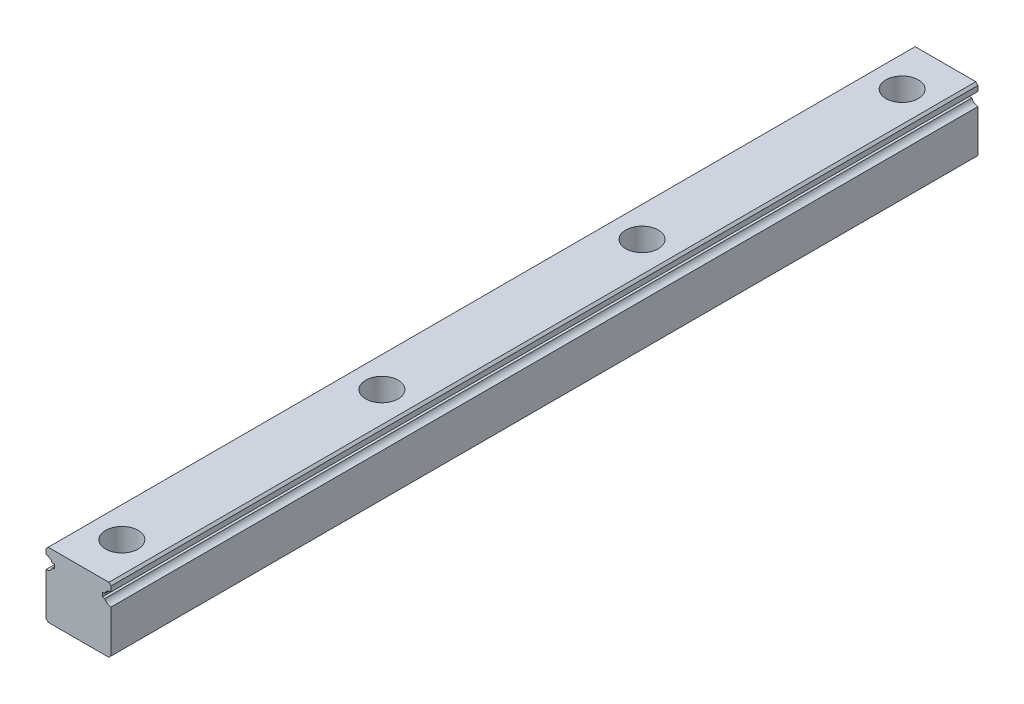
ISO-10303-21;
HEADER;
FILE_DESCRIPTION(('STEP AP214'),'2;1');
FILE_NAME('part.step','',(''),(''),'','','');
FILE_SCHEMA(('AUTOMOTIVE_DESIGN { 1 0 10303 214 1 1 1 1 }'));
ENDSEC;
DATA;
#1=APPLICATION_CONTEXT('core data for automotive mechanical design processes');
#2=APPLICATION_PROTOCOL_DEFINITION('international standard','automotive_design',2000,#1);
#3=PRODUCT_CONTEXT('',#1,'mechanical');
#4=PRODUCT('Part','Part','',(#3));
#5=PRODUCT_RELATED_PRODUCT_CATEGORY('part','',(#4));
#6=PRODUCT_DEFINITION_FORMATION('','',#4);
#7=PRODUCT_DEFINITION_CONTEXT('part definition',#1,'design');
#8=PRODUCT_DEFINITION('design','',#6,#7);
#9=PRODUCT_DEFINITION_SHAPE('','',#8);
#10=(LENGTH_UNIT() NAMED_UNIT(*) SI_UNIT(.MILLI.,.METRE.));
#11=(NAMED_UNIT(*) PLANE_ANGLE_UNIT() SI_UNIT($,.RADIAN.));
#12=(NAMED_UNIT(*) SI_UNIT($,.STERADIAN.) SOLID_ANGLE_UNIT());
#13=UNCERTAINTY_MEASURE_WITH_UNIT(LENGTH_MEASURE(1.E-05),#10,'distance_accuracy_value','');
#14=(GEOMETRIC_REPRESENTATION_CONTEXT(3) GLOBAL_UNCERTAINTY_ASSIGNED_CONTEXT((#13)) GLOBAL_UNIT_ASSIGNED_CONTEXT((#10,
#11,#12)) REPRESENTATION_CONTEXT('',''));
#15=CARTESIAN_POINT('',(0.,0.,0.));
#16=DIRECTION('',(0.,0.,1.));
#17=DIRECTION('',(1.,0.,0.));
#18=AXIS2_PLACEMENT_3D('',#15,#16,#17);
#19=CARTESIAN_POINT('',(-7.5,0.,200.));
#20=DIRECTION('',(1.,0.,0.));
#21=DIRECTION('',(0.,0.,-1.));
#22=AXIS2_PLACEMENT_3D('',#19,#20,#21);
#23=PLANE('',#22);
#24=DIRECTION('',(0.,-1.,0.));
#25=VECTOR('',#24,1.);
#26=CARTESIAN_POINT('',(-7.5,0.,0.));
#27=LINE('',#26,#25);
#28=CARTESIAN_POINT('',(-7.5,10.3,0.));
#29=VERTEX_POINT('',#28);
#30=CARTESIAN_POINT('',(-7.5,0.5,0.));
#31=VERTEX_POINT('',#30);
#32=EDGE_CURVE('E281',#29,#31,#27,.T.);
#33=ORIENTED_EDGE('',*,*,#32,.T.);
#34=DIRECTION('',(0.,0.,1.));
#35=VECTOR('',#34,1.);
#36=CARTESIAN_POINT('',(-7.5,0.5,200.));
#37=LINE('',#36,#35);
#38=CARTESIAN_POINT('',(-7.5,0.5,200.));
#39=VERTEX_POINT('',#38);
#40=EDGE_CURVE('E62',#31,#39,#37,.T.);
#41=ORIENTED_EDGE('',*,*,#40,.T.);
#42=DIRECTION('',(0.,-1.,0.));
#43=VECTOR('',#42,1.);
#44=CARTESIAN_POINT('',(-7.5,0.,200.));
#45=LINE('',#44,#43);
#46=CARTESIAN_POINT('',(-7.5,10.3,200.));
#47=VERTEX_POINT('',#46);
#48=EDGE_CURVE('E224',#47,#39,#45,.T.);
#49=ORIENTED_EDGE('',*,*,#48,.F.);
#50=DIRECTION('',(0.,0.,1.));
#51=VECTOR('',#50,1.);
#52=CARTESIAN_POINT('',(-7.5,10.3,-0.001000000000001));
#53=LINE('',#52,#51);
#54=EDGE_CURVE('E284',#29,#47,#53,.T.);
#55=ORIENTED_EDGE('',*,*,#54,.F.);
#56=EDGE_LOOP('',(#33,#41,#49,#55));
#57=FACE_BOUND('',#56,.T.);
#58=ADVANCED_FACE('F38',(#57),#23,.F.);
#59=CARTESIAN_POINT('',(7.5,0.,200.));
#60=DIRECTION('',(0.,1.,0.));
#61=DIRECTION('',(0.,0.,1.));
#62=AXIS2_PLACEMENT_3D('',#59,#60,#61);
#63=PLANE('',#62);
#64=CARTESIAN_POINT('',(0.,0.,10.));
#65=DIRECTION('',(0.,1.,0.));
#66=DIRECTION('',(0.,0.,1.));
#67=AXIS2_PLACEMENT_3D('',#64,#65,#66);
#68=CIRCLE('',#67,2.25);
#69=CARTESIAN_POINT('',(0.,0.,12.25));
#70=VERTEX_POINT('',#69);
#71=EDGE_CURVE('E403',#70,#70,#68,.T.);
#72=ORIENTED_EDGE('',*,*,#71,.T.);
#73=EDGE_LOOP('',(#72));
#74=FACE_BOUND('',#73,.T.);
#75=CARTESIAN_POINT('',(0.,0.,70.));
#76=DIRECTION('',(0.,1.,0.));
#77=DIRECTION('',(0.,0.,1.));
#78=AXIS2_PLACEMENT_3D('',#75,#76,#77);
#79=CIRCLE('',#78,2.25);
#80=CARTESIAN_POINT('',(0.,0.,72.25));
#81=VERTEX_POINT('',#80);
#82=EDGE_CURVE('E391',#81,#81,#79,.T.);
#83=ORIENTED_EDGE('',*,*,#82,.T.);
#84=EDGE_LOOP('',(#83));
#85=FACE_BOUND('',#84,.T.);
#86=CARTESIAN_POINT('',(0.,0.,130.));
#87=DIRECTION('',(0.,1.,0.));
#88=DIRECTION('',(0.,0.,1.));
#89=AXIS2_PLACEMENT_3D('',#86,#87,#88);
#90=CIRCLE('',#89,2.25);
#91=CARTESIAN_POINT('',(0.,0.,132.25));
#92=VERTEX_POINT('',#91);
#93=EDGE_CURVE('E379',#92,#92,#90,.T.);
#94=ORIENTED_EDGE('',*,*,#93,.T.);
#95=EDGE_LOOP('',(#94));
#96=FACE_BOUND('',#95,.T.);
#97=CARTESIAN_POINT('',(0.,0.,190.));
#98=DIRECTION('',(0.,1.,0.));
#99=DIRECTION('',(0.,0.,1.));
#100=AXIS2_PLACEMENT_3D('',#97,#98,#99);
#101=CIRCLE('',#100,2.25);
#102=CARTESIAN_POINT('',(0.,0.,192.25));
#103=VERTEX_POINT('',#102);
#104=EDGE_CURVE('E351',#103,#103,#101,.T.);
#105=ORIENTED_EDGE('',*,*,#104,.T.);
#106=EDGE_LOOP('',(#105));
#107=FACE_BOUND('',#106,.T.);
#108=DIRECTION('',(1.,0.,0.));
#109=VECTOR('',#108,1.);
#110=CARTESIAN_POINT('',(7.5,0.,200.));
#111=LINE('',#110,#109);
#112=CARTESIAN_POINT('',(-7.,0.,200.));
#113=VERTEX_POINT('',#112);
#114=CARTESIAN_POINT('',(7.,0.,200.));
#115=VERTEX_POINT('',#114);
#116=EDGE_CURVE('E268',#113,#115,#111,.T.);
#117=ORIENTED_EDGE('',*,*,#116,.F.);
#118=DIRECTION('',(0.,0.,-1.));
#119=VECTOR('',#118,1.);
#120=CARTESIAN_POINT('',(-7.,0.,200.));
#121=LINE('',#120,#119);
#122=CARTESIAN_POINT('',(-7.,0.,0.));
#123=VERTEX_POINT('',#122);
#124=EDGE_CURVE('E257',#113,#123,#121,.T.);
#125=ORIENTED_EDGE('',*,*,#124,.T.);
#126=DIRECTION('',(1.,0.,0.));
#127=VECTOR('',#126,1.);
#128=CARTESIAN_POINT('',(7.5,0.,0.));
#129=LINE('',#128,#127);
#130=CARTESIAN_POINT('',(7.,0.,0.));
#131=VERTEX_POINT('',#130);
#132=EDGE_CURVE('E282',#123,#131,#129,.T.);
#133=ORIENTED_EDGE('',*,*,#132,.T.);
#134=DIRECTION('',(0.,0.,1.));
#135=VECTOR('',#134,1.);
#136=CARTESIAN_POINT('',(7.,0.,200.));
#137=LINE('',#136,#135);
#138=EDGE_CURVE('E255',#131,#115,#137,.T.);
#139=ORIENTED_EDGE('',*,*,#138,.T.);
#140=EDGE_LOOP('',(#117,#125,#133,#139));
#141=FACE_BOUND('',#140,.T.);
#142=ADVANCED_FACE('F273',(#74,#85,#96,#107,#141),#63,.F.);
#143=CARTESIAN_POINT('',(7.5,0.,200.));
#144=DIRECTION('',(-1.,0.,0.));
#145=DIRECTION('',(0.,0.,1.));
#146=AXIS2_PLACEMENT_3D('',#143,#144,#145);
#147=PLANE('',#146);
#148=DIRECTION('',(0.,1.,0.));
#149=VECTOR('',#148,1.);
#150=CARTESIAN_POINT('',(7.5,0.,200.));
#151=LINE('',#150,#149);
#152=CARTESIAN_POINT('',(7.5,0.5,200.));
#153=VERTEX_POINT('',#152);
#154=CARTESIAN_POINT('',(7.5,10.3,200.));
#155=VERTEX_POINT('',#154);
#156=EDGE_CURVE('E276',#153,#155,#151,.T.);
#157=ORIENTED_EDGE('',*,*,#156,.F.);
#158=DIRECTION('',(0.,0.,-1.));
#159=VECTOR('',#158,1.);
#160=CARTESIAN_POINT('',(7.5,0.5,200.));
#161=LINE('',#160,#159);
#162=CARTESIAN_POINT('',(7.5,0.5,0.));
#163=VERTEX_POINT('',#162);
#164=EDGE_CURVE('E11',#153,#163,#161,.T.);
#165=ORIENTED_EDGE('',*,*,#164,.T.);
#166=DIRECTION('',(0.,1.,0.));
#167=VECTOR('',#166,1.);
#168=CARTESIAN_POINT('',(7.5,0.,0.));
#169=LINE('',#168,#167);
#170=CARTESIAN_POINT('',(7.5,10.3,0.));
#171=VERTEX_POINT('',#170);
#172=EDGE_CURVE('E287',#163,#171,#169,.T.);
#173=ORIENTED_EDGE('',*,*,#172,.T.);
#174=DIRECTION('',(0.,0.,1.));
#175=VECTOR('',#174,1.);
#176=CARTESIAN_POINT('',(7.5,10.3,-0.001000000000001));
#177=LINE('',#176,#175);
#178=EDGE_CURVE('E352',#155,#171,#177,.F.);
#179=ORIENTED_EDGE('',*,*,#178,.F.);
#180=EDGE_LOOP('',(#157,#165,#173,#179));
#181=FACE_BOUND('',#180,.T.);
#182=ADVANCED_FACE('F465',(#181),#147,.F.);
#183=CARTESIAN_POINT('',(7.5,11.3,200.));
#184=DIRECTION('',(0.,-1.,0.));
#185=DIRECTION('',(0.,0.,-1.));
#186=AXIS2_PLACEMENT_3D('',#183,#184,#185);
#187=PLANE('',#186);
#188=DIRECTION('',(-1.,0.,0.));
#189=VECTOR('',#188,1.);
#190=CARTESIAN_POINT('',(7.5,11.3,200.));
#191=LINE('',#190,#189);
#192=CARTESIAN_POINT('',(6.08578643762691,11.3,200.));
#193=VERTEX_POINT('',#192);
#194=CARTESIAN_POINT('',(5.5,11.3,200.));
#195=VERTEX_POINT('',#194);
#196=EDGE_CURVE('E312',#193,#195,#191,.T.);
#197=ORIENTED_EDGE('',*,*,#196,.F.);
#198=DIRECTION('',(0.,0.,1.));
#199=VECTOR('',#198,1.);
#200=CARTESIAN_POINT('',(6.08578643762691,11.3,-0.001000000000001));
#201=LINE('',#200,#199);
#202=CARTESIAN_POINT('',(6.08578643762691,11.3,0.));
#203=VERTEX_POINT('',#202);
#204=EDGE_CURVE('E345',#203,#193,#201,.T.);
#205=ORIENTED_EDGE('',*,*,#204,.F.);
#206=DIRECTION('',(-1.,0.,0.));
#207=VECTOR('',#206,1.);
#208=CARTESIAN_POINT('',(7.5,11.3,0.));
#209=LINE('',#208,#207);
#210=CARTESIAN_POINT('',(5.5,11.3,0.));
#211=VERTEX_POINT('',#210);
#212=EDGE_CURVE('E295',#203,#211,#209,.T.);
#213=ORIENTED_EDGE('',*,*,#212,.T.);
#214=DIRECTION('',(0.,0.,-1.));
#215=VECTOR('',#214,1.);
#216=CARTESIAN_POINT('',(5.5,11.3,200.));
#217=LINE('',#216,#215);
#218=EDGE_CURVE('E235',#195,#211,#217,.T.);
#219=ORIENTED_EDGE('',*,*,#218,.F.);
#220=EDGE_LOOP('',(#197,#205,#213,#219));
#221=FACE_BOUND('',#220,.T.);
#222=ADVANCED_FACE('F344',(#221),#187,.F.);
#223=CARTESIAN_POINT('',(5.5,11.3,200.));
#224=DIRECTION('',(-1.,0.,0.));
#225=DIRECTION('',(0.,0.,1.));
#226=AXIS2_PLACEMENT_3D('',#223,#224,#225);
#227=PLANE('',#226);
#228=DIRECTION('',(0.,1.,0.));
#229=VECTOR('',#228,1.);
#230=CARTESIAN_POINT('',(5.5,11.3,0.));
#231=LINE('',#230,#229);
#232=CARTESIAN_POINT('',(5.5,12.3,0.));
#233=VERTEX_POINT('',#232);
#234=EDGE_CURVE('E212',#211,#233,#231,.T.);
#235=ORIENTED_EDGE('',*,*,#234,.T.);
#236=DIRECTION('',(0.,0.,-1.));
#237=VECTOR('',#236,1.);
#238=CARTESIAN_POINT('',(5.5,12.3,200.));
#239=LINE('',#238,#237);
#240=CARTESIAN_POINT('',(5.5,12.3,200.));
#241=VERTEX_POINT('',#240);
#242=EDGE_CURVE('E232',#241,#233,#239,.T.);
#243=ORIENTED_EDGE('',*,*,#242,.F.);
#244=DIRECTION('',(0.,1.,0.));
#245=VECTOR('',#244,1.);
#246=CARTESIAN_POINT('',(5.5,11.3,200.));
#247=LINE('',#246,#245);
#248=EDGE_CURVE('E308',#195,#241,#247,.T.);
#249=ORIENTED_EDGE('',*,*,#248,.F.);
#250=ORIENTED_EDGE('',*,*,#218,.T.);
#251=EDGE_LOOP('',(#235,#243,#249,#250));
#252=FACE_BOUND('',#251,.T.);
#253=ADVANCED_FACE('F299',(#252),#227,.F.);
#254=CARTESIAN_POINT('',(5.5,12.3,200.));
#255=DIRECTION('',(0.,1.,0.));
#256=DIRECTION('',(0.,0.,1.));
#257=AXIS2_PLACEMENT_3D('',#254,#255,#256);
#258=PLANE('',#257);
#259=DIRECTION('',(1.,0.,0.));
#260=VECTOR('',#259,1.);
#261=CARTESIAN_POINT('',(5.5,12.3,0.));
#262=LINE('',#261,#260);
#263=CARTESIAN_POINT('',(6.08578643762691,12.3,0.));
#264=VERTEX_POINT('',#263);
#265=EDGE_CURVE('E207',#233,#264,#262,.T.);
#266=ORIENTED_EDGE('',*,*,#265,.T.);
#267=DIRECTION('',(0.,0.,1.));
#268=VECTOR('',#267,1.);
#269=CARTESIAN_POINT('',(6.08578643762691,12.3,-0.001000000000001));
#270=LINE('',#269,#268);
#271=CARTESIAN_POINT('',(6.08578643762691,12.3,200.));
#272=VERTEX_POINT('',#271);
#273=EDGE_CURVE('E184',#272,#264,#270,.F.);
#274=ORIENTED_EDGE('',*,*,#273,.F.);
#275=DIRECTION('',(1.,0.,0.));
#276=VECTOR('',#275,1.);
#277=CARTESIAN_POINT('',(5.5,12.3,200.));
#278=LINE('',#277,#276);
#279=EDGE_CURVE('E307',#241,#272,#278,.T.);
#280=ORIENTED_EDGE('',*,*,#279,.F.);
#281=ORIENTED_EDGE('',*,*,#242,.T.);
#282=EDGE_LOOP('',(#266,#274,#280,#281));
#283=FACE_BOUND('',#282,.T.);
#284=ADVANCED_FACE('F305',(#283),#258,.F.);
#285=CARTESIAN_POINT('',(7.5,12.3,200.));
#286=DIRECTION('',(-1.,0.,0.));
#287=DIRECTION('',(0.,0.,1.));
#288=AXIS2_PLACEMENT_3D('',#285,#286,#287);
#289=PLANE('',#288);
#290=DIRECTION('',(0.,1.,0.));
#291=VECTOR('',#290,1.);
#292=CARTESIAN_POINT('',(7.5,12.3,0.));
#293=LINE('',#292,#291);
#294=CARTESIAN_POINT('',(7.5,13.3,0.));
#295=VERTEX_POINT('',#294);
#296=CARTESIAN_POINT('',(7.5,14.5,0.));
#297=VERTEX_POINT('',#296);
#298=EDGE_CURVE('E196',#295,#297,#293,.T.);
#299=ORIENTED_EDGE('',*,*,#298,.T.);
#300=DIRECTION('',(0.,0.,1.));
#301=VECTOR('',#300,1.);
#302=CARTESIAN_POINT('',(7.5,14.5,200.));
#303=LINE('',#302,#301);
#304=CARTESIAN_POINT('',(7.5,14.5,200.));
#305=VERTEX_POINT('',#304);
#306=EDGE_CURVE('E253',#297,#305,#303,.T.);
#307=ORIENTED_EDGE('',*,*,#306,.T.);
#308=DIRECTION('',(0.,1.,0.));
#309=VECTOR('',#308,1.);
#310=CARTESIAN_POINT('',(7.5,12.3,200.));
#311=LINE('',#310,#309);
#312=CARTESIAN_POINT('',(7.5,13.3,200.));
#313=VERTEX_POINT('',#312);
#314=EDGE_CURVE('E199',#313,#305,#311,.T.);
#315=ORIENTED_EDGE('',*,*,#314,.F.);
#316=DIRECTION('',(0.,0.,1.));
#317=VECTOR('',#316,1.);
#318=CARTESIAN_POINT('',(7.5,13.3,-0.001000000000001));
#319=LINE('',#318,#317);
#320=EDGE_CURVE('E181',#295,#313,#319,.T.);
#321=ORIENTED_EDGE('',*,*,#320,.F.);
#322=EDGE_LOOP('',(#299,#307,#315,#321));
#323=FACE_BOUND('',#322,.T.);
#324=ADVANCED_FACE('F195',(#323),#289,.F.);
#325=CARTESIAN_POINT('',(-7.5,15.,200.));
#326=DIRECTION('',(0.,-1.,0.));
#327=DIRECTION('',(0.,0.,-1.));
#328=AXIS2_PLACEMENT_3D('',#325,#326,#327);
#329=PLANE('',#328);
#330=CARTESIAN_POINT('',(0.,15.,10.));
#331=DIRECTION('',(0.,1.,0.));
#332=DIRECTION('',(0.,0.,1.));
#333=AXIS2_PLACEMENT_3D('',#330,#331,#332);
#334=CIRCLE('',#333,3.74999999999999);
#335=CARTESIAN_POINT('',(0.,15.,13.75));
#336=VERTEX_POINT('',#335);
#337=EDGE_CURVE('E412',#336,#336,#334,.T.);
#338=ORIENTED_EDGE('',*,*,#337,.F.);
#339=EDGE_LOOP('',(#338));
#340=FACE_BOUND('',#339,.T.);
#341=CARTESIAN_POINT('',(0.,15.,70.));
#342=DIRECTION('',(0.,1.,0.));
#343=DIRECTION('',(0.,0.,1.));
#344=AXIS2_PLACEMENT_3D('',#341,#342,#343);
#345=CIRCLE('',#344,3.74999999999999);
#346=CARTESIAN_POINT('',(0.,15.,73.75));
#347=VERTEX_POINT('',#346);
#348=EDGE_CURVE('E400',#347,#347,#345,.T.);
#349=ORIENTED_EDGE('',*,*,#348,.F.);
#350=EDGE_LOOP('',(#349));
#351=FACE_BOUND('',#350,.T.);
#352=CARTESIAN_POINT('',(0.,15.,130.));
#353=DIRECTION('',(0.,1.,0.));
#354=DIRECTION('',(0.,0.,1.));
#355=AXIS2_PLACEMENT_3D('',#352,#353,#354);
#356=CIRCLE('',#355,3.74999999999999);
#357=CARTESIAN_POINT('',(0.,15.,133.75));
#358=VERTEX_POINT('',#357);
#359=EDGE_CURVE('E388',#358,#358,#356,.T.);
#360=ORIENTED_EDGE('',*,*,#359,.F.);
#361=EDGE_LOOP('',(#360));
#362=FACE_BOUND('',#361,.T.);
#363=CARTESIAN_POINT('',(0.,15.,190.));
#364=DIRECTION('',(0.,1.,0.));
#365=DIRECTION('',(0.,0.,1.));
#366=AXIS2_PLACEMENT_3D('',#363,#364,#365);
#367=CIRCLE('',#366,3.74999999999999);
#368=CARTESIAN_POINT('',(0.,15.,193.75));
#369=VERTEX_POINT('',#368);
#370=EDGE_CURVE('E376',#369,#369,#367,.T.);
#371=ORIENTED_EDGE('',*,*,#370,.F.);
#372=EDGE_LOOP('',(#371));
#373=FACE_BOUND('',#372,.T.);
#374=DIRECTION('',(-1.,0.,0.));
#375=VECTOR('',#374,1.);
#376=CARTESIAN_POINT('',(-7.5,15.,0.));
#377=LINE('',#376,#375);
#378=CARTESIAN_POINT('',(6.99999999999994,15.,0.));
#379=VERTEX_POINT('',#378);
#380=CARTESIAN_POINT('',(-6.99999999999997,15.,0.));
#381=VERTEX_POINT('',#380);
#382=EDGE_CURVE('E206',#379,#381,#377,.T.);
#383=ORIENTED_EDGE('',*,*,#382,.T.);
#384=DIRECTION('',(0.,0.,1.));
#385=VECTOR('',#384,1.);
#386=CARTESIAN_POINT('',(-6.99999999999997,15.,200.));
#387=LINE('',#386,#385);
#388=CARTESIAN_POINT('',(-6.99999999999997,15.,200.));
#389=VERTEX_POINT('',#388);
#390=EDGE_CURVE('E247',#381,#389,#387,.T.);
#391=ORIENTED_EDGE('',*,*,#390,.T.);
#392=DIRECTION('',(-1.,0.,0.));
#393=VECTOR('',#392,1.);
#394=CARTESIAN_POINT('',(-7.5,15.,200.));
#395=LINE('',#394,#393);
#396=CARTESIAN_POINT('',(6.99999999999994,15.,200.));
#397=VERTEX_POINT('',#396);
#398=EDGE_CURVE('E310',#397,#389,#395,.T.);
#399=ORIENTED_EDGE('',*,*,#398,.F.);
#400=DIRECTION('',(0.,0.,-1.));
#401=VECTOR('',#400,1.);
#402=CARTESIAN_POINT('',(6.99999999999994,15.,200.));
#403=LINE('',#402,#401);
#404=EDGE_CURVE('E244',#397,#379,#403,.T.);
#405=ORIENTED_EDGE('',*,*,#404,.T.);
#406=EDGE_LOOP('',(#383,#391,#399,#405));
#407=FACE_BOUND('',#406,.T.);
#408=ADVANCED_FACE('F418',(#340,#351,#362,#373,#407),#329,.F.);
#409=CARTESIAN_POINT('',(-7.5,12.3,200.));
#410=DIRECTION('',(1.,0.,0.));
#411=DIRECTION('',(0.,0.,-1.));
#412=AXIS2_PLACEMENT_3D('',#409,#410,#411);
#413=PLANE('',#412);
#414=DIRECTION('',(0.,-1.,0.));
#415=VECTOR('',#414,1.);
#416=CARTESIAN_POINT('',(-7.5,12.3,200.));
#417=LINE('',#416,#415);
#418=CARTESIAN_POINT('',(-7.5,14.5,200.));
#419=VERTEX_POINT('',#418);
#420=CARTESIAN_POINT('',(-7.5,13.3,200.));
#421=VERTEX_POINT('',#420);
#422=EDGE_CURVE('E318',#419,#421,#417,.T.);
#423=ORIENTED_EDGE('',*,*,#422,.F.);
#424=DIRECTION('',(0.,0.,-1.));
#425=VECTOR('',#424,1.);
#426=CARTESIAN_POINT('',(-7.5,14.5,200.));
#427=LINE('',#426,#425);
#428=CARTESIAN_POINT('',(-7.5,14.5,0.));
#429=VERTEX_POINT('',#428);
#430=EDGE_CURVE('E238',#419,#429,#427,.T.);
#431=ORIENTED_EDGE('',*,*,#430,.T.);
#432=DIRECTION('',(0.,-1.,0.));
#433=VECTOR('',#432,1.);
#434=CARTESIAN_POINT('',(-7.5,12.3,0.));
#435=LINE('',#434,#433);
#436=CARTESIAN_POINT('',(-7.5,13.3,0.));
#437=VERTEX_POINT('',#436);
#438=EDGE_CURVE('E210',#429,#437,#435,.T.);
#439=ORIENTED_EDGE('',*,*,#438,.T.);
#440=DIRECTION('',(0.,0.,1.));
#441=VECTOR('',#440,1.);
#442=CARTESIAN_POINT('',(-7.5,13.3,-0.001000000000001));
#443=LINE('',#442,#441);
#444=EDGE_CURVE('E358',#421,#437,#443,.F.);
#445=ORIENTED_EDGE('',*,*,#444,.F.);
#446=EDGE_LOOP('',(#423,#431,#439,#445));
#447=FACE_BOUND('',#446,.T.);
#448=ADVANCED_FACE('F421',(#447),#413,.F.);
#449=CARTESIAN_POINT('',(-5.5,12.3,200.));
#450=DIRECTION('',(0.,1.,0.));
#451=DIRECTION('',(0.,0.,1.));
#452=AXIS2_PLACEMENT_3D('',#449,#450,#451);
#453=PLANE('',#452);
#454=DIRECTION('',(1.,0.,0.));
#455=VECTOR('',#454,1.);
#456=CARTESIAN_POINT('',(-5.5,12.3,200.));
#457=LINE('',#456,#455);
#458=CARTESIAN_POINT('',(-6.08578643762691,12.3,200.));
#459=VERTEX_POINT('',#458);
#460=CARTESIAN_POINT('',(-5.5,12.3,200.));
#461=VERTEX_POINT('',#460);
#462=EDGE_CURVE('E320',#459,#461,#457,.T.);
#463=ORIENTED_EDGE('',*,*,#462,.F.);
#464=DIRECTION('',(0.,0.,1.));
#465=VECTOR('',#464,1.);
#466=CARTESIAN_POINT('',(-6.08578643762691,12.3,-0.001000000000001));
#467=LINE('',#466,#465);
#468=CARTESIAN_POINT('',(-6.08578643762691,12.3,0.));
#469=VERTEX_POINT('',#468);
#470=EDGE_CURVE('E365',#469,#459,#467,.T.);
#471=ORIENTED_EDGE('',*,*,#470,.F.);
#472=DIRECTION('',(1.,0.,0.));
#473=VECTOR('',#472,1.);
#474=CARTESIAN_POINT('',(-5.5,12.3,0.));
#475=LINE('',#474,#473);
#476=CARTESIAN_POINT('',(-5.5,12.3,0.));
#477=VERTEX_POINT('',#476);
#478=EDGE_CURVE('E217',#469,#477,#475,.T.);
#479=ORIENTED_EDGE('',*,*,#478,.T.);
#480=DIRECTION('',(0.,0.,-1.));
#481=VECTOR('',#480,1.);
#482=CARTESIAN_POINT('',(-5.5,12.3,200.));
#483=LINE('',#482,#481);
#484=EDGE_CURVE('E228',#461,#477,#483,.T.);
#485=ORIENTED_EDGE('',*,*,#484,.F.);
#486=EDGE_LOOP('',(#463,#471,#479,#485));
#487=FACE_BOUND('',#486,.T.);
#488=ADVANCED_FACE('F449',(#487),#453,.F.);
#489=CARTESIAN_POINT('',(-5.5,11.3,200.));
#490=DIRECTION('',(1.,0.,0.));
#491=DIRECTION('',(0.,0.,-1.));
#492=AXIS2_PLACEMENT_3D('',#489,#490,#491);
#493=PLANE('',#492);
#494=DIRECTION('',(0.,-1.,0.));
#495=VECTOR('',#494,1.);
#496=CARTESIAN_POINT('',(-5.5,11.3,0.));
#497=LINE('',#496,#495);
#498=CARTESIAN_POINT('',(-5.5,11.3,0.));
#499=VERTEX_POINT('',#498);
#500=EDGE_CURVE('E219',#477,#499,#497,.T.);
#501=ORIENTED_EDGE('',*,*,#500,.T.);
#502=DIRECTION('',(0.,0.,-1.));
#503=VECTOR('',#502,1.);
#504=CARTESIAN_POINT('',(-5.5,11.3,200.));
#505=LINE('',#504,#503);
#506=CARTESIAN_POINT('',(-5.5,11.3,200.));
#507=VERTEX_POINT('',#506);
#508=EDGE_CURVE('E225',#507,#499,#505,.T.);
#509=ORIENTED_EDGE('',*,*,#508,.F.);
#510=DIRECTION('',(0.,-1.,0.));
#511=VECTOR('',#510,1.);
#512=CARTESIAN_POINT('',(-5.5,11.3,200.));
#513=LINE('',#512,#511);
#514=EDGE_CURVE('E321',#461,#507,#513,.T.);
#515=ORIENTED_EDGE('',*,*,#514,.F.);
#516=ORIENTED_EDGE('',*,*,#484,.T.);
#517=EDGE_LOOP('',(#501,#509,#515,#516));
#518=FACE_BOUND('',#517,.T.);
#519=ADVANCED_FACE('F451',(#518),#493,.F.);
#520=CARTESIAN_POINT('',(-7.5,11.3,200.));
#521=DIRECTION('',(0.,-1.,0.));
#522=DIRECTION('',(0.,0.,-1.));
#523=AXIS2_PLACEMENT_3D('',#520,#521,#522);
#524=PLANE('',#523);
#525=DIRECTION('',(-1.,0.,0.));
#526=VECTOR('',#525,1.);
#527=CARTESIAN_POINT('',(-7.5,11.3,0.));
#528=LINE('',#527,#526);
#529=CARTESIAN_POINT('',(-6.08578643762691,11.3,0.));
#530=VERTEX_POINT('',#529);
#531=EDGE_CURVE('E221',#499,#530,#528,.T.);
#532=ORIENTED_EDGE('',*,*,#531,.T.);
#533=DIRECTION('',(0.,0.,1.));
#534=VECTOR('',#533,1.);
#535=CARTESIAN_POINT('',(-6.08578643762691,11.3,-0.001000000000001));
#536=LINE('',#535,#534);
#537=CARTESIAN_POINT('',(-6.08578643762691,11.3,200.));
#538=VERTEX_POINT('',#537);
#539=EDGE_CURVE('E189',#538,#530,#536,.F.);
#540=ORIENTED_EDGE('',*,*,#539,.F.);
#541=DIRECTION('',(-1.,0.,0.));
#542=VECTOR('',#541,1.);
#543=CARTESIAN_POINT('',(-7.5,11.3,200.));
#544=LINE('',#543,#542);
#545=EDGE_CURVE('E229',#507,#538,#544,.T.);
#546=ORIENTED_EDGE('',*,*,#545,.F.);
#547=ORIENTED_EDGE('',*,*,#508,.T.);
#548=EDGE_LOOP('',(#532,#540,#546,#547));
#549=FACE_BOUND('',#548,.T.);
#550=ADVANCED_FACE('F328',(#549),#524,.F.);
#551=CARTESIAN_POINT('',(0.,0.,200.));
#552=DIRECTION('',(0.,0.,-1.));
#553=DIRECTION('',(-1.,0.,0.));
#554=AXIS2_PLACEMENT_3D('',#551,#552,#553);
#555=PLANE('',#554);
#556=ORIENTED_EDGE('',*,*,#48,.T.);
#557=DIRECTION('',(-0.707106781186548,0.707106781186548,0.));
#558=VECTOR('',#557,1.);
#559=CARTESIAN_POINT('',(-7.,0.,200.));
#560=LINE('',#559,#558);
#561=EDGE_CURVE('E47',#39,#113,#560,.F.);
#562=ORIENTED_EDGE('',*,*,#561,.T.);
#563=ORIENTED_EDGE('',*,*,#116,.T.);
#564=DIRECTION('',(-0.707106781186548,-0.707106781186548,0.));
#565=VECTOR('',#564,1.);
#566=CARTESIAN_POINT('',(7.5,0.5,200.));
#567=LINE('',#566,#565);
#568=EDGE_CURVE('E54',#115,#153,#567,.F.);
#569=ORIENTED_EDGE('',*,*,#568,.T.);
#570=ORIENTED_EDGE('',*,*,#156,.T.);
#571=CARTESIAN_POINT('',(7.5,11.8,200.));
#572=DIRECTION('',(0.,0.,1.));
#573=DIRECTION('',(-1.,0.,0.));
#574=AXIS2_PLACEMENT_3D('',#571,#572,#573);
#575=CIRCLE('',#574,1.5);
#576=EDGE_CURVE('E334',#193,#155,#575,.T.);
#577=ORIENTED_EDGE('',*,*,#576,.F.);
#578=ORIENTED_EDGE('',*,*,#196,.T.);
#579=ORIENTED_EDGE('',*,*,#248,.T.);
#580=ORIENTED_EDGE('',*,*,#279,.T.);
#581=CARTESIAN_POINT('',(7.5,11.8,200.));
#582=DIRECTION('',(0.,0.,1.));
#583=DIRECTION('',(-1.,0.,0.));
#584=AXIS2_PLACEMENT_3D('',#581,#582,#583);
#585=CIRCLE('',#584,1.5);
#586=EDGE_CURVE('E190',#313,#272,#585,.T.);
#587=ORIENTED_EDGE('',*,*,#586,.F.);
#588=ORIENTED_EDGE('',*,*,#314,.T.);
#589=DIRECTION('',(0.707106781186567,-0.707106781186528,0.));
#590=VECTOR('',#589,1.);
#591=CARTESIAN_POINT('',(6.99999999999994,15.,200.));
#592=LINE('',#591,#590);
#593=EDGE_CURVE('E249',#305,#397,#592,.F.);
#594=ORIENTED_EDGE('',*,*,#593,.T.);
#595=ORIENTED_EDGE('',*,*,#398,.T.);
#596=DIRECTION('',(0.707106781186548,0.707106781186548,0.));
#597=VECTOR('',#596,1.);
#598=CARTESIAN_POINT('',(-7.5,14.5,200.));
#599=LINE('',#598,#597);
#600=EDGE_CURVE('E251',#389,#419,#599,.F.);
#601=ORIENTED_EDGE('',*,*,#600,.T.);
#602=ORIENTED_EDGE('',*,*,#422,.T.);
#603=CARTESIAN_POINT('',(-7.5,11.8,200.));
#604=DIRECTION('',(0.,0.,1.));
#605=DIRECTION('',(1.,0.,0.));
#606=AXIS2_PLACEMENT_3D('',#603,#604,#605);
#607=CIRCLE('',#606,1.5);
#608=EDGE_CURVE('E200',#459,#421,#607,.T.);
#609=ORIENTED_EDGE('',*,*,#608,.F.);
#610=ORIENTED_EDGE('',*,*,#462,.T.);
#611=ORIENTED_EDGE('',*,*,#514,.T.);
#612=ORIENTED_EDGE('',*,*,#545,.T.);
#613=CARTESIAN_POINT('',(-7.5,11.8,200.));
#614=DIRECTION('',(0.,0.,1.));
#615=DIRECTION('',(1.,0.,0.));
#616=AXIS2_PLACEMENT_3D('',#613,#614,#615);
#617=CIRCLE('',#616,1.5);
#618=EDGE_CURVE('E289',#47,#538,#617,.T.);
#619=ORIENTED_EDGE('',*,*,#618,.F.);
#620=EDGE_LOOP('',(#556,#562,#563,#569,#570,#577,#578,#579,#580,#587,#588,#594,#595,#601,#602,
#609,#610,#611,#612,#619));
#621=FACE_BOUND('',#620,.T.);
#622=ADVANCED_FACE('F267',(#621),#555,.F.);
#623=CARTESIAN_POINT('',(0.,0.,0.));
#624=DIRECTION('',(0.,0.,-1.));
#625=DIRECTION('',(-1.,0.,0.));
#626=AXIS2_PLACEMENT_3D('',#623,#624,#625);
#627=PLANE('',#626);
#628=ORIENTED_EDGE('',*,*,#132,.F.);
#629=DIRECTION('',(0.707106781186548,-0.707106781186548,0.));
#630=VECTOR('',#629,1.);
#631=CARTESIAN_POINT('',(-3.5,-3.5,0.));
#632=LINE('',#631,#630);
#633=EDGE_CURVE('E262',#123,#31,#632,.F.);
#634=ORIENTED_EDGE('',*,*,#633,.T.);
#635=ORIENTED_EDGE('',*,*,#32,.F.);
#636=CARTESIAN_POINT('',(-7.5,11.8,0.));
#637=DIRECTION('',(0.,0.,-1.));
#638=DIRECTION('',(-1.,0.,0.));
#639=AXIS2_PLACEMENT_3D('',#636,#637,#638);
#640=CIRCLE('',#639,1.5);
#641=EDGE_CURVE('E285',#29,#530,#640,.F.);
#642=ORIENTED_EDGE('',*,*,#641,.T.);
#643=ORIENTED_EDGE('',*,*,#531,.F.);
#644=ORIENTED_EDGE('',*,*,#500,.F.);
#645=ORIENTED_EDGE('',*,*,#478,.F.);
#646=CARTESIAN_POINT('',(-7.5,11.8,0.));
#647=DIRECTION('',(0.,0.,-1.));
#648=DIRECTION('',(-1.,0.,0.));
#649=AXIS2_PLACEMENT_3D('',#646,#647,#648);
#650=CIRCLE('',#649,1.5);
#651=EDGE_CURVE('E362',#469,#437,#650,.F.);
#652=ORIENTED_EDGE('',*,*,#651,.T.);
#653=ORIENTED_EDGE('',*,*,#438,.F.);
#654=DIRECTION('',(-0.707106781186548,-0.707106781186548,0.));
#655=VECTOR('',#654,1.);
#656=CARTESIAN_POINT('',(-11.,11.,0.));
#657=LINE('',#656,#655);
#658=EDGE_CURVE('E242',#429,#381,#657,.F.);
#659=ORIENTED_EDGE('',*,*,#658,.T.);
#660=ORIENTED_EDGE('',*,*,#382,.F.);
#661=DIRECTION('',(-0.707106781186567,0.707106781186528,0.));
#662=VECTOR('',#661,1.);
#663=CARTESIAN_POINT('',(10.9999999999998,11.0000000000004,0.));
#664=LINE('',#663,#662);
#665=EDGE_CURVE('E205',#379,#297,#664,.F.);
#666=ORIENTED_EDGE('',*,*,#665,.T.);
#667=ORIENTED_EDGE('',*,*,#298,.F.);
#668=CARTESIAN_POINT('',(7.5,11.8,0.));
#669=DIRECTION('',(0.,0.,-1.));
#670=DIRECTION('',(-1.,0.,0.));
#671=AXIS2_PLACEMENT_3D('',#668,#669,#670);
#672=CIRCLE('',#671,1.5);
#673=EDGE_CURVE('E178',#295,#264,#672,.F.);
#674=ORIENTED_EDGE('',*,*,#673,.T.);
#675=ORIENTED_EDGE('',*,*,#265,.F.);
#676=ORIENTED_EDGE('',*,*,#234,.F.);
#677=ORIENTED_EDGE('',*,*,#212,.F.);
#678=CARTESIAN_POINT('',(7.5,11.8,0.));
#679=DIRECTION('',(0.,0.,-1.));
#680=DIRECTION('',(-1.,0.,0.));
#681=AXIS2_PLACEMENT_3D('',#678,#679,#680);
#682=CIRCLE('',#681,1.5);
#683=EDGE_CURVE('E348',#203,#171,#682,.F.);
#684=ORIENTED_EDGE('',*,*,#683,.T.);
#685=ORIENTED_EDGE('',*,*,#172,.F.);
#686=DIRECTION('',(0.707106781186548,0.707106781186548,0.));
#687=VECTOR('',#686,1.);
#688=CARTESIAN_POINT('',(3.5,-3.5,0.));
#689=LINE('',#688,#687);
#690=EDGE_CURVE('E260',#163,#131,#689,.F.);
#691=ORIENTED_EDGE('',*,*,#690,.T.);
#692=EDGE_LOOP('',(#628,#634,#635,#642,#643,#644,#645,#652,#653,#659,#660,#666,#667,#674,#675,
#676,#677,#684,#685,#691));
#693=FACE_BOUND('',#692,.T.);
#694=ADVANCED_FACE('F203',(#693),#627,.T.);
#695=CARTESIAN_POINT('',(-7.5,11.8,-0.001000000000001));
#696=DIRECTION('',(0.,0.,1.));
#697=DIRECTION('',(1.,0.,0.));
#698=AXIS2_PLACEMENT_3D('',#695,#696,#697);
#699=CYLINDRICAL_SURFACE('',#698,1.5);
#700=ORIENTED_EDGE('',*,*,#54,.T.);
#701=ORIENTED_EDGE('',*,*,#618,.T.);
#702=ORIENTED_EDGE('',*,*,#539,.T.);
#703=ORIENTED_EDGE('',*,*,#641,.F.);
#704=EDGE_LOOP('',(#700,#701,#702,#703));
#705=FACE_BOUND('',#704,.T.);
#706=ADVANCED_FACE('F508',(#705),#699,.F.);
#707=CARTESIAN_POINT('',(7.5,11.8,-0.001000000000001));
#708=DIRECTION('',(0.,0.,1.));
#709=DIRECTION('',(1.,0.,0.));
#710=AXIS2_PLACEMENT_3D('',#707,#708,#709);
#711=CYLINDRICAL_SURFACE('',#710,1.5);
#712=ORIENTED_EDGE('',*,*,#273,.T.);
#713=ORIENTED_EDGE('',*,*,#673,.F.);
#714=ORIENTED_EDGE('',*,*,#320,.T.);
#715=ORIENTED_EDGE('',*,*,#586,.T.);
#716=EDGE_LOOP('',(#712,#713,#714,#715));
#717=FACE_BOUND('',#716,.T.);
#718=ADVANCED_FACE('F180',(#717),#711,.F.);
#719=CARTESIAN_POINT('',(-7.5,11.8,-0.001000000000001));
#720=DIRECTION('',(0.,0.,1.));
#721=DIRECTION('',(1.,0.,0.));
#722=AXIS2_PLACEMENT_3D('',#719,#720,#721);
#723=CYLINDRICAL_SURFACE('',#722,1.5);
#724=ORIENTED_EDGE('',*,*,#444,.T.);
#725=ORIENTED_EDGE('',*,*,#651,.F.);
#726=ORIENTED_EDGE('',*,*,#470,.T.);
#727=ORIENTED_EDGE('',*,*,#608,.T.);
#728=EDGE_LOOP('',(#724,#725,#726,#727));
#729=FACE_BOUND('',#728,.T.);
#730=ADVANCED_FACE('F442',(#729),#723,.F.);
#731=CARTESIAN_POINT('',(7.5,11.8,-0.001000000000001));
#732=DIRECTION('',(0.,0.,1.));
#733=DIRECTION('',(1.,0.,0.));
#734=AXIS2_PLACEMENT_3D('',#731,#732,#733);
#735=CYLINDRICAL_SURFACE('',#734,1.5);
#736=ORIENTED_EDGE('',*,*,#178,.T.);
#737=ORIENTED_EDGE('',*,*,#683,.F.);
#738=ORIENTED_EDGE('',*,*,#204,.T.);
#739=ORIENTED_EDGE('',*,*,#576,.T.);
#740=EDGE_LOOP('',(#736,#737,#738,#739));
#741=FACE_BOUND('',#740,.T.);
#742=ADVANCED_FACE('F477',(#741),#735,.F.);
#743=CARTESIAN_POINT('',(-7.5,14.5,200.));
#744=DIRECTION('',(0.707106781186548,-0.707106781186548,0.));
#745=DIRECTION('',(0.,0.,-1.));
#746=AXIS2_PLACEMENT_3D('',#743,#744,#745);
#747=PLANE('',#746);
#748=ORIENTED_EDGE('',*,*,#600,.F.);
#749=ORIENTED_EDGE('',*,*,#390,.F.);
#750=ORIENTED_EDGE('',*,*,#658,.F.);
#751=ORIENTED_EDGE('',*,*,#430,.F.);
#752=EDGE_LOOP('',(#748,#749,#750,#751));
#753=FACE_BOUND('',#752,.T.);
#754=ADVANCED_FACE('F434',(#753),#747,.F.);
#755=CARTESIAN_POINT('',(6.99999999999994,15.,200.));
#756=DIRECTION('',(-0.707106781186528,-0.707106781186567,0.));
#757=DIRECTION('',(0.,0.,-1.));
#758=AXIS2_PLACEMENT_3D('',#755,#756,#757);
#759=PLANE('',#758);
#760=ORIENTED_EDGE('',*,*,#593,.F.);
#761=ORIENTED_EDGE('',*,*,#306,.F.);
#762=ORIENTED_EDGE('',*,*,#665,.F.);
#763=ORIENTED_EDGE('',*,*,#404,.F.);
#764=EDGE_LOOP('',(#760,#761,#762,#763));
#765=FACE_BOUND('',#764,.T.);
#766=ADVANCED_FACE('F476',(#765),#759,.F.);
#767=CARTESIAN_POINT('',(-7.,0.,200.));
#768=DIRECTION('',(0.707106781186547,0.707106781186547,0.));
#769=DIRECTION('',(0.,0.,-1.));
#770=AXIS2_PLACEMENT_3D('',#767,#768,#769);
#771=PLANE('',#770);
#772=ORIENTED_EDGE('',*,*,#561,.F.);
#773=ORIENTED_EDGE('',*,*,#40,.F.);
#774=ORIENTED_EDGE('',*,*,#633,.F.);
#775=ORIENTED_EDGE('',*,*,#124,.F.);
#776=EDGE_LOOP('',(#772,#773,#774,#775));
#777=FACE_BOUND('',#776,.T.);
#778=ADVANCED_FACE('F278',(#777),#771,.F.);
#779=CARTESIAN_POINT('',(7.5,0.5,200.));
#780=DIRECTION('',(-0.707106781186547,0.707106781186547,0.));
#781=DIRECTION('',(0.,0.,-1.));
#782=AXIS2_PLACEMENT_3D('',#779,#780,#781);
#783=PLANE('',#782);
#784=ORIENTED_EDGE('',*,*,#568,.F.);
#785=ORIENTED_EDGE('',*,*,#138,.F.);
#786=ORIENTED_EDGE('',*,*,#690,.F.);
#787=ORIENTED_EDGE('',*,*,#164,.F.);
#788=EDGE_LOOP('',(#784,#785,#786,#787));
#789=FACE_BOUND('',#788,.T.);
#790=ADVANCED_FACE('F41',(#789),#783,.F.);
#791=CARTESIAN_POINT('',(0.,15.,190.));
#792=DIRECTION('',(0.,1.,0.));
#793=DIRECTION('',(0.,0.,1.));
#794=AXIS2_PLACEMENT_3D('',#791,#792,#793);
#795=CYLINDRICAL_SURFACE('',#794,2.25);
#796=ORIENTED_EDGE('',*,*,#104,.F.);
#797=EDGE_LOOP('',(#796));
#798=FACE_BOUND('',#797,.T.);
#799=CARTESIAN_POINT('',(0.,9.7,190.));
#800=DIRECTION('',(0.,1.,0.));
#801=DIRECTION('',(0.,0.,1.));
#802=AXIS2_PLACEMENT_3D('',#799,#800,#801);
#803=CIRCLE('',#802,2.25);
#804=CARTESIAN_POINT('',(0.,9.7,192.25));
#805=VERTEX_POINT('',#804);
#806=EDGE_CURVE('E354',#805,#805,#803,.T.);
#807=ORIENTED_EDGE('',*,*,#806,.T.);
#808=EDGE_LOOP('',(#807));
#809=FACE_BOUND('',#808,.T.);
#810=ADVANCED_FACE('F489',(#798,#809),#795,.F.);
#811=CARTESIAN_POINT('',(2.25000000000002,9.7,190.));
#812=DIRECTION('',(0.,-1.,0.));
#813=DIRECTION('',(0.,0.,-1.));
#814=AXIS2_PLACEMENT_3D('',#811,#812,#813);
#815=PLANE('',#814);
#816=ORIENTED_EDGE('',*,*,#806,.F.);
#817=EDGE_LOOP('',(#816));
#818=FACE_BOUND('',#817,.T.);
#819=CARTESIAN_POINT('',(0.,9.7,190.));
#820=DIRECTION('',(0.,1.,0.));
#821=DIRECTION('',(0.,0.,1.));
#822=AXIS2_PLACEMENT_3D('',#819,#820,#821);
#823=CIRCLE('',#822,3.75);
#824=CARTESIAN_POINT('',(0.,9.7,193.75));
#825=VERTEX_POINT('',#824);
#826=EDGE_CURVE('E373',#825,#825,#823,.T.);
#827=ORIENTED_EDGE('',*,*,#826,.T.);
#828=EDGE_LOOP('',(#827));
#829=FACE_BOUND('',#828,.T.);
#830=ADVANCED_FACE('F494',(#818,#829),#815,.F.);
#831=CARTESIAN_POINT('',(0.,15.,190.));
#832=DIRECTION('',(0.,1.,0.));
#833=DIRECTION('',(0.,0.,1.));
#834=AXIS2_PLACEMENT_3D('',#831,#832,#833);
#835=CYLINDRICAL_SURFACE('',#834,3.74999999999999);
#836=ORIENTED_EDGE('',*,*,#826,.F.);
#837=EDGE_LOOP('',(#836));
#838=FACE_BOUND('',#837,.T.);
#839=ORIENTED_EDGE('',*,*,#370,.T.);
#840=EDGE_LOOP('',(#839));
#841=FACE_BOUND('',#840,.T.);
#842=ADVANCED_FACE('F638',(#838,#841),#835,.F.);
#843=CARTESIAN_POINT('',(0.,15.,130.));
#844=DIRECTION('',(0.,1.,0.));
#845=DIRECTION('',(0.,0.,1.));
#846=AXIS2_PLACEMENT_3D('',#843,#844,#845);
#847=CYLINDRICAL_SURFACE('',#846,2.25);
#848=ORIENTED_EDGE('',*,*,#93,.F.);
#849=EDGE_LOOP('',(#848));
#850=FACE_BOUND('',#849,.T.);
#851=CARTESIAN_POINT('',(0.,9.7,130.));
#852=DIRECTION('',(0.,1.,0.));
#853=DIRECTION('',(0.,0.,1.));
#854=AXIS2_PLACEMENT_3D('',#851,#852,#853);
#855=CIRCLE('',#854,2.25);
#856=CARTESIAN_POINT('',(0.,9.7,132.25));
#857=VERTEX_POINT('',#856);
#858=EDGE_CURVE('E382',#857,#857,#855,.T.);
#859=ORIENTED_EDGE('',*,*,#858,.T.);
#860=EDGE_LOOP('',(#859));
#861=FACE_BOUND('',#860,.T.);
#862=ADVANCED_FACE('F648',(#850,#861),#847,.F.);
#863=CARTESIAN_POINT('',(2.25000000000002,9.7,130.));
#864=DIRECTION('',(0.,-1.,0.));
#865=DIRECTION('',(0.,0.,-1.));
#866=AXIS2_PLACEMENT_3D('',#863,#864,#865);
#867=PLANE('',#866);
#868=ORIENTED_EDGE('',*,*,#858,.F.);
#869=EDGE_LOOP('',(#868));
#870=FACE_BOUND('',#869,.T.);
#871=CARTESIAN_POINT('',(0.,9.7,130.));
#872=DIRECTION('',(0.,1.,0.));
#873=DIRECTION('',(0.,0.,1.));
#874=AXIS2_PLACEMENT_3D('',#871,#872,#873);
#875=CIRCLE('',#874,3.75);
#876=CARTESIAN_POINT('',(0.,9.7,133.75));
#877=VERTEX_POINT('',#876);
#878=EDGE_CURVE('E385',#877,#877,#875,.T.);
#879=ORIENTED_EDGE('',*,*,#878,.T.);
#880=EDGE_LOOP('',(#879));
#881=FACE_BOUND('',#880,.T.);
#882=ADVANCED_FACE('F653',(#870,#881),#867,.F.);
#883=CARTESIAN_POINT('',(0.,15.,130.));
#884=DIRECTION('',(0.,1.,0.));
#885=DIRECTION('',(0.,0.,1.));
#886=AXIS2_PLACEMENT_3D('',#883,#884,#885);
#887=CYLINDRICAL_SURFACE('',#886,3.74999999999999);
#888=ORIENTED_EDGE('',*,*,#878,.F.);
#889=EDGE_LOOP('',(#888));
#890=FACE_BOUND('',#889,.T.);
#891=ORIENTED_EDGE('',*,*,#359,.T.);
#892=EDGE_LOOP('',(#891));
#893=FACE_BOUND('',#892,.T.);
#894=ADVANCED_FACE('F663',(#890,#893),#887,.F.);
#895=CARTESIAN_POINT('',(0.,15.,70.));
#896=DIRECTION('',(0.,1.,0.));
#897=DIRECTION('',(0.,0.,1.));
#898=AXIS2_PLACEMENT_3D('',#895,#896,#897);
#899=CYLINDRICAL_SURFACE('',#898,2.25);
#900=ORIENTED_EDGE('',*,*,#82,.F.);
#901=EDGE_LOOP('',(#900));
#902=FACE_BOUND('',#901,.T.);
#903=CARTESIAN_POINT('',(0.,9.7,70.));
#904=DIRECTION('',(0.,1.,0.));
#905=DIRECTION('',(0.,0.,1.));
#906=AXIS2_PLACEMENT_3D('',#903,#904,#905);
#907=CIRCLE('',#906,2.25);
#908=CARTESIAN_POINT('',(0.,9.7,72.25));
#909=VERTEX_POINT('',#908);
#910=EDGE_CURVE('E394',#909,#909,#907,.T.);
#911=ORIENTED_EDGE('',*,*,#910,.T.);
#912=EDGE_LOOP('',(#911));
#913=FACE_BOUND('',#912,.T.);
#914=ADVANCED_FACE('F673',(#902,#913),#899,.F.);
#915=CARTESIAN_POINT('',(2.25000000000002,9.7,70.));
#916=DIRECTION('',(0.,-1.,0.));
#917=DIRECTION('',(0.,0.,-1.));
#918=AXIS2_PLACEMENT_3D('',#915,#916,#917);
#919=PLANE('',#918);
#920=ORIENTED_EDGE('',*,*,#910,.F.);
#921=EDGE_LOOP('',(#920));
#922=FACE_BOUND('',#921,.T.);
#923=CARTESIAN_POINT('',(0.,9.7,70.));
#924=DIRECTION('',(0.,1.,0.));
#925=DIRECTION('',(0.,0.,1.));
#926=AXIS2_PLACEMENT_3D('',#923,#924,#925);
#927=CIRCLE('',#926,3.75);
#928=CARTESIAN_POINT('',(0.,9.7,73.75));
#929=VERTEX_POINT('',#928);
#930=EDGE_CURVE('E397',#929,#929,#927,.T.);
#931=ORIENTED_EDGE('',*,*,#930,.T.);
#932=EDGE_LOOP('',(#931));
#933=FACE_BOUND('',#932,.T.);
#934=ADVANCED_FACE('F683',(#922,#933),#919,.F.);
#935=CARTESIAN_POINT('',(0.,15.,70.));
#936=DIRECTION('',(0.,1.,0.));
#937=DIRECTION('',(0.,0.,1.));
#938=AXIS2_PLACEMENT_3D('',#935,#936,#937);
#939=CYLINDRICAL_SURFACE('',#938,3.74999999999999);
#940=ORIENTED_EDGE('',*,*,#930,.F.);
#941=EDGE_LOOP('',(#940));
#942=FACE_BOUND('',#941,.T.);
#943=ORIENTED_EDGE('',*,*,#348,.T.);
#944=EDGE_LOOP('',(#943));
#945=FACE_BOUND('',#944,.T.);
#946=ADVANCED_FACE('F693',(#942,#945),#939,.F.);
#947=CARTESIAN_POINT('',(0.,15.,10.));
#948=DIRECTION('',(0.,1.,0.));
#949=DIRECTION('',(0.,0.,1.));
#950=AXIS2_PLACEMENT_3D('',#947,#948,#949);
#951=CYLINDRICAL_SURFACE('',#950,2.25);
#952=ORIENTED_EDGE('',*,*,#71,.F.);
#953=EDGE_LOOP('',(#952));
#954=FACE_BOUND('',#953,.T.);
#955=CARTESIAN_POINT('',(0.,9.7,10.));
#956=DIRECTION('',(0.,1.,0.));
#957=DIRECTION('',(0.,0.,1.));
#958=AXIS2_PLACEMENT_3D('',#955,#956,#957);
#959=CIRCLE('',#958,2.25);
#960=CARTESIAN_POINT('',(0.,9.7,12.25));
#961=VERTEX_POINT('',#960);
#962=EDGE_CURVE('E406',#961,#961,#959,.T.);
#963=ORIENTED_EDGE('',*,*,#962,.T.);
#964=EDGE_LOOP('',(#963));
#965=FACE_BOUND('',#964,.T.);
#966=ADVANCED_FACE('F703',(#954,#965),#951,.F.);
#967=CARTESIAN_POINT('',(2.25000000000002,9.7,10.));
#968=DIRECTION('',(0.,-1.,0.));
#969=DIRECTION('',(0.,0.,-1.));
#970=AXIS2_PLACEMENT_3D('',#967,#968,#969);
#971=PLANE('',#970);
#972=ORIENTED_EDGE('',*,*,#962,.F.);
#973=EDGE_LOOP('',(#972));
#974=FACE_BOUND('',#973,.T.);
#975=CARTESIAN_POINT('',(0.,9.7,10.));
#976=DIRECTION('',(0.,1.,0.));
#977=DIRECTION('',(0.,0.,1.));
#978=AXIS2_PLACEMENT_3D('',#975,#976,#977);
#979=CIRCLE('',#978,3.75);
#980=CARTESIAN_POINT('',(0.,9.7,13.75));
#981=VERTEX_POINT('',#980);
#982=EDGE_CURVE('E409',#981,#981,#979,.T.);
#983=ORIENTED_EDGE('',*,*,#982,.T.);
#984=EDGE_LOOP('',(#983));
#985=FACE_BOUND('',#984,.T.);
#986=ADVANCED_FACE('F713',(#974,#985),#971,.F.);
#987=CARTESIAN_POINT('',(0.,15.,10.));
#988=DIRECTION('',(0.,1.,0.));
#989=DIRECTION('',(0.,0.,1.));
#990=AXIS2_PLACEMENT_3D('',#987,#988,#989);
#991=CYLINDRICAL_SURFACE('',#990,3.74999999999999);
#992=ORIENTED_EDGE('',*,*,#982,.F.);
#993=EDGE_LOOP('',(#992));
#994=FACE_BOUND('',#993,.T.);
#995=ORIENTED_EDGE('',*,*,#337,.T.);
#996=EDGE_LOOP('',(#995));
#997=FACE_BOUND('',#996,.T.);
#998=ADVANCED_FACE('F416',(#994,#997),#991,.F.);
#999=CLOSED_SHELL('',(#58,#142,#182,#222,#253,#284,#324,#408,#448,#488,#519,#550,#622,#694,#706,
#718,#730,#742,#754,#766,#778,#790,#810,#830,#842,#862,#882,#894,#914,#934,#946,#966,#986,#998));
#1000=MANIFOLD_SOLID_BREP('B2',#999);
#1001=ADVANCED_BREP_SHAPE_REPRESENTATION('',(#18,#1000),#14);
#1002=SHAPE_DEFINITION_REPRESENTATION(#9,#1001);
ENDSEC;
END-ISO-10303-21;
